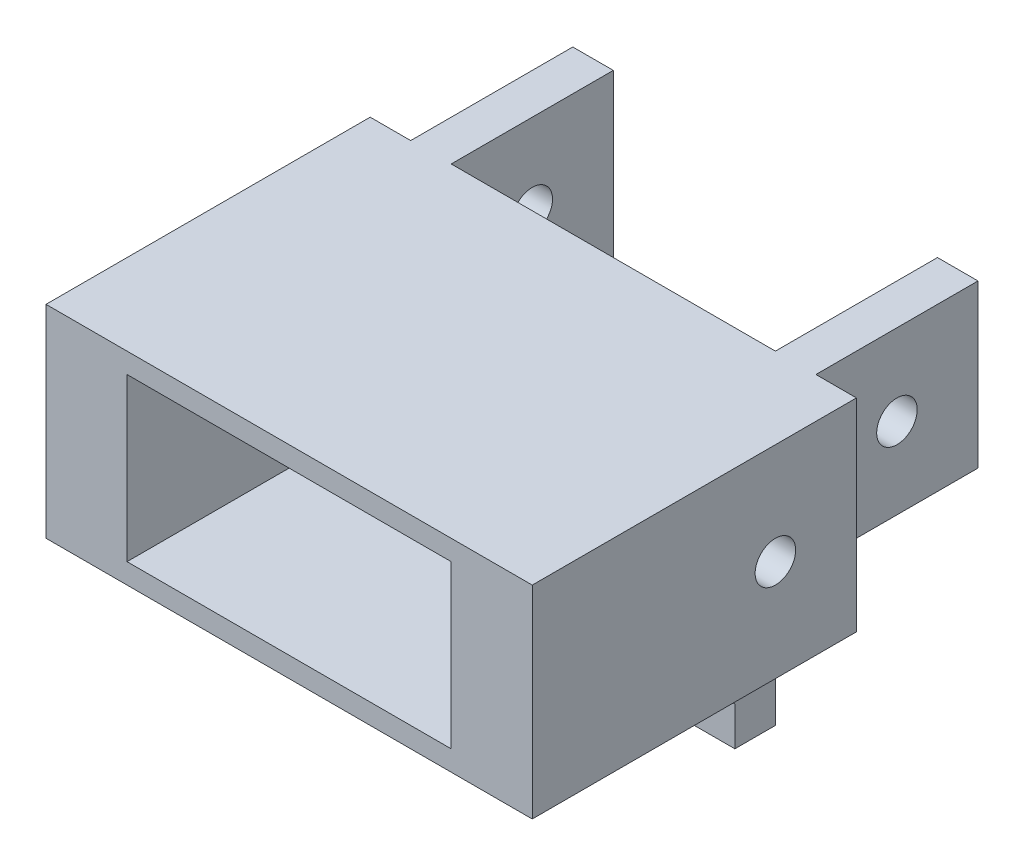
ISO-10303-21;
HEADER;
FILE_DESCRIPTION(('STEP AP214'),'2;1');
FILE_NAME('part.step','',(''),(''),'','','');
FILE_SCHEMA(('AUTOMOTIVE_DESIGN { 1 0 10303 214 1 1 1 1 }'));
ENDSEC;
DATA;
#1=APPLICATION_CONTEXT('core data for automotive mechanical design processes');
#2=APPLICATION_PROTOCOL_DEFINITION('international standard','automotive_design',2000,#1);
#3=PRODUCT_CONTEXT('',#1,'mechanical');
#4=PRODUCT('Part','Part','',(#3));
#5=PRODUCT_RELATED_PRODUCT_CATEGORY('part','',(#4));
#6=PRODUCT_DEFINITION_FORMATION('','',#4);
#7=PRODUCT_DEFINITION_CONTEXT('part definition',#1,'design');
#8=PRODUCT_DEFINITION('design','',#6,#7);
#9=PRODUCT_DEFINITION_SHAPE('','',#8);
#10=(LENGTH_UNIT() NAMED_UNIT(*) SI_UNIT(.MILLI.,.METRE.));
#11=(NAMED_UNIT(*) PLANE_ANGLE_UNIT() SI_UNIT($,.RADIAN.));
#12=(NAMED_UNIT(*) SI_UNIT($,.STERADIAN.) SOLID_ANGLE_UNIT());
#13=UNCERTAINTY_MEASURE_WITH_UNIT(LENGTH_MEASURE(1.E-05),#10,'distance_accuracy_value','');
#14=(GEOMETRIC_REPRESENTATION_CONTEXT(3) GLOBAL_UNCERTAINTY_ASSIGNED_CONTEXT((#13)) GLOBAL_UNIT_ASSIGNED_CONTEXT((#10,
#11,#12)) REPRESENTATION_CONTEXT('',''));
#15=CARTESIAN_POINT('',(0.,0.,0.));
#16=DIRECTION('',(0.,0.,1.));
#17=DIRECTION('',(1.,0.,0.));
#18=AXIS2_PLACEMENT_3D('',#15,#16,#17);
#19=CARTESIAN_POINT('',(4.80999618440597,-4.9502101992266,15.));
#20=DIRECTION('',(-1.,0.,0.));
#21=DIRECTION('',(0.,-1.,0.));
#22=AXIS2_PLACEMENT_3D('',#19,#20,#21);
#23=PLANE('',#22);
#24=DIRECTION('',(0.,0.707106781186548,0.707106781186547));
#25=VECTOR('',#24,1.);
#26=CARTESIAN_POINT('',(4.80999618440597,-4.9502101992266,15.));
#27=LINE('',#26,#25);
#28=CARTESIAN_POINT('',(4.80999618440597,-14.9502101992266,5.));
#29=VERTEX_POINT('',#28);
#30=CARTESIAN_POINT('',(4.80999618440597,-4.9502101992266,15.));
#31=VERTEX_POINT('',#30);
#32=EDGE_CURVE('E457',#29,#31,#27,.T.);
#33=ORIENTED_EDGE('',*,*,#32,.F.);
#34=DIRECTION('',(0.,1.,0.));
#35=VECTOR('',#34,1.);
#36=CARTESIAN_POINT('',(4.80999618440597,-4.9502101992266,5.));
#37=LINE('',#36,#35);
#38=CARTESIAN_POINT('',(4.80999618440597,-4.9502101992266,5.));
#39=VERTEX_POINT('',#38);
#40=EDGE_CURVE('E253',#29,#39,#37,.T.);
#41=ORIENTED_EDGE('',*,*,#40,.T.);
#42=DIRECTION('',(0.,0.,-1.));
#43=VECTOR('',#42,1.);
#44=CARTESIAN_POINT('',(4.80999618440597,-4.9502101992266,15.));
#45=LINE('',#44,#43);
#46=EDGE_CURVE('E66',#31,#39,#45,.T.);
#47=ORIENTED_EDGE('',*,*,#46,.F.);
#48=EDGE_LOOP('',(#33,#41,#47));
#49=FACE_BOUND('',#48,.T.);
#50=ADVANCED_FACE('F41',(#49),#23,.F.);
#51=CARTESIAN_POINT('',(-13.8285621725772,-4.9502101992266,15.));
#52=DIRECTION('',(1.,0.,0.));
#53=DIRECTION('',(0.,1.,0.));
#54=AXIS2_PLACEMENT_3D('',#51,#52,#53);
#55=PLANE('',#54);
#56=DIRECTION('',(0.,0.,-1.));
#57=VECTOR('',#56,1.);
#58=CARTESIAN_POINT('',(-13.8285621725772,-4.9502101992266,15.));
#59=LINE('',#58,#57);
#60=CARTESIAN_POINT('',(-13.8285621725772,-4.9502101992266,15.));
#61=VERTEX_POINT('',#60);
#62=CARTESIAN_POINT('',(-13.8285621725772,-4.9502101992266,5.));
#63=VERTEX_POINT('',#62);
#64=EDGE_CURVE('E265',#61,#63,#59,.T.);
#65=ORIENTED_EDGE('',*,*,#64,.F.);
#66=DIRECTION('',(0.,-0.707106781186548,-0.707106781186547));
#67=VECTOR('',#66,1.);
#68=CARTESIAN_POINT('',(-13.8285621725772,-4.9502101992266,15.));
#69=LINE('',#68,#67);
#70=CARTESIAN_POINT('',(-13.8285621725772,-14.9502101992266,5.));
#71=VERTEX_POINT('',#70);
#72=EDGE_CURVE('E459',#61,#71,#69,.T.);
#73=ORIENTED_EDGE('',*,*,#72,.T.);
#74=DIRECTION('',(0.,-1.,0.));
#75=VECTOR('',#74,1.);
#76=CARTESIAN_POINT('',(-13.8285621725772,-4.9502101992266,5.));
#77=LINE('',#76,#75);
#78=EDGE_CURVE('E266',#63,#71,#77,.T.);
#79=ORIENTED_EDGE('',*,*,#78,.F.);
#80=EDGE_LOOP('',(#65,#73,#79));
#81=FACE_BOUND('',#80,.T.);
#82=ADVANCED_FACE('F546',(#81),#55,.T.);
#83=CARTESIAN_POINT('',(0.,0.,5.));
#84=DIRECTION('',(0.,0.,-1.));
#85=DIRECTION('',(-1.,0.,0.));
#86=AXIS2_PLACEMENT_3D('',#83,#84,#85);
#87=PLANE('',#86);
#88=CARTESIAN_POINT('',(13.1714378274228,-9.9502101992266,5.));
#89=DIRECTION('',(0.,0.,1.));
#90=DIRECTION('',(1.,0.,0.));
#91=AXIS2_PLACEMENT_3D('',#88,#89,#90);
#92=CIRCLE('',#91,2.5);
#93=CARTESIAN_POINT('',(15.6714378274228,-9.9502101992266,5.));
#94=VERTEX_POINT('',#93);
#95=EDGE_CURVE('E424',#94,#94,#92,.T.);
#96=ORIENTED_EDGE('',*,*,#95,.F.);
#97=EDGE_LOOP('',(#96));
#98=FACE_BOUND('',#97,.T.);
#99=CARTESIAN_POINT('',(-6.82856217257722,-9.9502101992266,5.));
#100=DIRECTION('',(0.,0.,1.));
#101=DIRECTION('',(1.,0.,0.));
#102=AXIS2_PLACEMENT_3D('',#99,#100,#101);
#103=CIRCLE('',#102,2.49999999999999);
#104=CARTESIAN_POINT('',(-4.32856217257723,-9.9502101992266,5.));
#105=VERTEX_POINT('',#104);
#106=EDGE_CURVE('E410',#105,#105,#103,.T.);
#107=ORIENTED_EDGE('',*,*,#106,.F.);
#108=EDGE_LOOP('',(#107));
#109=FACE_BOUND('',#108,.T.);
#110=DIRECTION('',(0.,-1.,0.));
#111=VECTOR('',#110,1.);
#112=CARTESIAN_POINT('',(20.1714378274228,-4.9502101992266,5.));
#113=LINE('',#112,#111);
#114=CARTESIAN_POINT('',(20.1714378274228,-4.9502101992266,5.));
#115=VERTEX_POINT('',#114);
#116=CARTESIAN_POINT('',(20.1714378274228,-15.1699441027605,5.));
#117=VERTEX_POINT('',#116);
#118=EDGE_CURVE('E237',#115,#117,#113,.T.);
#119=ORIENTED_EDGE('',*,*,#118,.F.);
#120=DIRECTION('',(-1.,0.,0.));
#121=VECTOR('',#120,1.);
#122=CARTESIAN_POINT('',(23.1714378274228,-4.9502101992266,5.));
#123=LINE('',#122,#121);
#124=EDGE_CURVE('E440',#115,#39,#123,.T.);
#125=ORIENTED_EDGE('',*,*,#124,.T.);
#126=ORIENTED_EDGE('',*,*,#40,.F.);
#127=DIRECTION('',(1.,0.,0.));
#128=VECTOR('',#127,1.);
#129=CARTESIAN_POINT('',(1.80999618440597,-14.9502101992266,5.));
#130=LINE('',#129,#128);
#131=CARTESIAN_POINT('',(1.80999618440597,-14.9502101992266,5.));
#132=VERTEX_POINT('',#131);
#133=EDGE_CURVE('E255',#132,#29,#130,.T.);
#134=ORIENTED_EDGE('',*,*,#133,.F.);
#135=DIRECTION('',(0.,-1.,0.));
#136=VECTOR('',#135,1.);
#137=CARTESIAN_POINT('',(1.80999618440597,-4.9502101992266,5.));
#138=LINE('',#137,#136);
#139=CARTESIAN_POINT('',(1.80999618440597,-4.9502101992266,5.));
#140=VERTEX_POINT('',#139);
#141=EDGE_CURVE('E58',#140,#132,#138,.T.);
#142=ORIENTED_EDGE('',*,*,#141,.F.);
#143=EDGE_CURVE('E438',#140,#63,#123,.T.);
#144=ORIENTED_EDGE('',*,*,#143,.T.);
#145=ORIENTED_EDGE('',*,*,#78,.T.);
#146=DIRECTION('',(1.,0.,0.));
#147=VECTOR('',#146,1.);
#148=CARTESIAN_POINT('',(-16.8285621725772,-14.9502101992266,5.));
#149=LINE('',#148,#147);
#150=CARTESIAN_POINT('',(-16.8285621725772,-14.9502101992266,5.));
#151=VERTEX_POINT('',#150);
#152=EDGE_CURVE('E249',#151,#71,#149,.T.);
#153=ORIENTED_EDGE('',*,*,#152,.F.);
#154=DIRECTION('',(0.,1.,0.));
#155=VECTOR('',#154,1.);
#156=CARTESIAN_POINT('',(-16.8285621725772,-19.9502101992266,5.));
#157=LINE('',#156,#155);
#158=CARTESIAN_POINT('',(-16.8285621725772,-19.9502101992266,5.));
#159=VERTEX_POINT('',#158);
#160=EDGE_CURVE('E436',#159,#151,#157,.T.);
#161=ORIENTED_EDGE('',*,*,#160,.F.);
#162=DIRECTION('',(-1.,0.,0.));
#163=VECTOR('',#162,1.);
#164=CARTESIAN_POINT('',(23.1714378274228,-19.9502101992266,5.));
#165=LINE('',#164,#163);
#166=CARTESIAN_POINT('',(23.1714378274228,-19.9502101992266,5.));
#167=VERTEX_POINT('',#166);
#168=EDGE_CURVE('E432',#167,#159,#165,.T.);
#169=ORIENTED_EDGE('',*,*,#168,.F.);
#170=DIRECTION('',(0.,-1.,0.));
#171=VECTOR('',#170,1.);
#172=CARTESIAN_POINT('',(23.1714378274228,-4.9502101992266,5.));
#173=LINE('',#172,#171);
#174=CARTESIAN_POINT('',(23.1714378274228,-15.1699441027605,5.));
#175=VERTEX_POINT('',#174);
#176=EDGE_CURVE('E244',#175,#167,#173,.T.);
#177=ORIENTED_EDGE('',*,*,#176,.F.);
#178=DIRECTION('',(1.,0.,0.));
#179=VECTOR('',#178,1.);
#180=CARTESIAN_POINT('',(20.1714378274228,-15.1699441027605,5.));
#181=LINE('',#180,#179);
#182=EDGE_CURVE('E228',#117,#175,#181,.T.);
#183=ORIENTED_EDGE('',*,*,#182,.F.);
#184=EDGE_LOOP('',(#119,#125,#126,#134,#142,#144,#145,#153,#161,#169,#177,#183));
#185=FACE_BOUND('',#184,.T.);
#186=ADVANCED_FACE('F242',(#98,#109,#185),#87,.F.);
#187=CARTESIAN_POINT('',(33.1714378274228,-4.9502101992266,40.));
#188=DIRECTION('',(0.,-1.,0.));
#189=DIRECTION('',(1.,0.,0.));
#190=AXIS2_PLACEMENT_3D('',#187,#188,#189);
#191=PLANE('',#190);
#192=ORIENTED_EDGE('',*,*,#124,.F.);
#193=DIRECTION('',(0.,0.,-1.));
#194=VECTOR('',#193,1.);
#195=CARTESIAN_POINT('',(20.1714378274228,-4.9502101992266,15.));
#196=LINE('',#195,#194);
#197=CARTESIAN_POINT('',(20.1714378274228,-4.9502101992266,15.));
#198=VERTEX_POINT('',#197);
#199=EDGE_CURVE('E239',#198,#115,#196,.T.);
#200=ORIENTED_EDGE('',*,*,#199,.F.);
#201=DIRECTION('',(-1.,0.,0.));
#202=VECTOR('',#201,1.);
#203=CARTESIAN_POINT('',(20.1714378274228,-4.9502101992266,15.));
#204=LINE('',#203,#202);
#205=CARTESIAN_POINT('',(23.1714378274228,-4.9502101992266,15.));
#206=VERTEX_POINT('',#205);
#207=EDGE_CURVE('E231',#206,#198,#204,.T.);
#208=ORIENTED_EDGE('',*,*,#207,.F.);
#209=DIRECTION('',(0.,0.,-1.));
#210=VECTOR('',#209,1.);
#211=CARTESIAN_POINT('',(23.1714378274228,-4.9502101992266,5.));
#212=LINE('',#211,#210);
#213=CARTESIAN_POINT('',(23.1714378274228,-4.9502101992266,0.));
#214=VERTEX_POINT('',#213);
#215=EDGE_CURVE('E11',#206,#214,#212,.T.);
#216=ORIENTED_EDGE('',*,*,#215,.T.);
#217=DIRECTION('',(-1.,0.,0.));
#218=VECTOR('',#217,1.);
#219=CARTESIAN_POINT('',(33.1714378274228,-4.9502101992266,0.));
#220=LINE('',#219,#218);
#221=CARTESIAN_POINT('',(33.1714378274228,-4.9502101992266,0.));
#222=VERTEX_POINT('',#221);
#223=EDGE_CURVE('E387',#222,#214,#220,.T.);
#224=ORIENTED_EDGE('',*,*,#223,.F.);
#225=DIRECTION('',(0.,0.,-1.));
#226=VECTOR('',#225,1.);
#227=CARTESIAN_POINT('',(33.1714378274228,-4.9502101992266,40.));
#228=LINE('',#227,#226);
#229=CARTESIAN_POINT('',(33.1714378274228,-4.9502101992266,40.));
#230=VERTEX_POINT('',#229);
#231=EDGE_CURVE('E408',#230,#222,#228,.T.);
#232=ORIENTED_EDGE('',*,*,#231,.F.);
#233=DIRECTION('',(-1.,0.,0.));
#234=VECTOR('',#233,1.);
#235=CARTESIAN_POINT('',(23.1714378274228,-4.9502101992266,40.));
#236=LINE('',#235,#234);
#237=CARTESIAN_POINT('',(-26.8285621725772,-4.95021019922661,40.));
#238=VERTEX_POINT('',#237);
#239=EDGE_CURVE('E384',#230,#238,#236,.T.);
#240=ORIENTED_EDGE('',*,*,#239,.T.);
#241=DIRECTION('',(0.,0.,-1.));
#242=VECTOR('',#241,1.);
#243=CARTESIAN_POINT('',(-26.8285621725772,-4.95021019922661,40.));
#244=LINE('',#243,#242);
#245=CARTESIAN_POINT('',(-26.8285621725772,-4.95021019922661,0.));
#246=VERTEX_POINT('',#245);
#247=EDGE_CURVE('E395',#238,#246,#244,.T.);
#248=ORIENTED_EDGE('',*,*,#247,.T.);
#249=CARTESIAN_POINT('',(-16.8285621725772,-4.9502101992266,0.));
#250=VERTEX_POINT('',#249);
#251=EDGE_CURVE('E405',#250,#246,#220,.T.);
#252=ORIENTED_EDGE('',*,*,#251,.F.);
#253=DIRECTION('',(0.,0.,-1.));
#254=VECTOR('',#253,1.);
#255=CARTESIAN_POINT('',(-16.8285621725772,-4.9502101992266,5.));
#256=LINE('',#255,#254);
#257=CARTESIAN_POINT('',(-16.8285621725772,-4.9502101992266,15.));
#258=VERTEX_POINT('',#257);
#259=EDGE_CURVE('E50',#258,#250,#256,.T.);
#260=ORIENTED_EDGE('',*,*,#259,.F.);
#261=DIRECTION('',(1.,0.,0.));
#262=VECTOR('',#261,1.);
#263=CARTESIAN_POINT('',(-16.8285621725772,-4.9502101992266,15.));
#264=LINE('',#263,#262);
#265=EDGE_CURVE('E263',#258,#61,#264,.T.);
#266=ORIENTED_EDGE('',*,*,#265,.T.);
#267=ORIENTED_EDGE('',*,*,#64,.T.);
#268=ORIENTED_EDGE('',*,*,#143,.F.);
#269=DIRECTION('',(0.,0.,-1.));
#270=VECTOR('',#269,1.);
#271=CARTESIAN_POINT('',(1.80999618440597,-4.9502101992266,15.));
#272=LINE('',#271,#270);
#273=CARTESIAN_POINT('',(1.80999618440597,-4.9502101992266,15.));
#274=VERTEX_POINT('',#273);
#275=EDGE_CURVE('E252',#274,#140,#272,.T.);
#276=ORIENTED_EDGE('',*,*,#275,.F.);
#277=DIRECTION('',(-1.,0.,0.));
#278=VECTOR('',#277,1.);
#279=CARTESIAN_POINT('',(1.80999618440597,-4.9502101992266,15.));
#280=LINE('',#279,#278);
#281=EDGE_CURVE('E250',#31,#274,#280,.T.);
#282=ORIENTED_EDGE('',*,*,#281,.F.);
#283=ORIENTED_EDGE('',*,*,#46,.T.);
#284=EDGE_LOOP('',(#192,#200,#208,#216,#224,#232,#240,#248,#252,#260,#266,#267,#268,#276,#282,#283));
#285=FACE_BOUND('',#284,.T.);
#286=ADVANCED_FACE('F479',(#285),#191,.T.);
#287=CARTESIAN_POINT('',(0.,0.,0.));
#288=DIRECTION('',(0.,0.,-1.));
#289=DIRECTION('',(-1.,0.,0.));
#290=AXIS2_PLACEMENT_3D('',#287,#288,#289);
#291=PLANE('',#290);
#292=DIRECTION('',(0.,-1.,0.));
#293=VECTOR('',#292,1.);
#294=CARTESIAN_POINT('',(-21.8285621725772,20.0497898007734,0.));
#295=LINE('',#294,#293);
#296=CARTESIAN_POINT('',(-21.8285621725772,20.0497898007734,0.));
#297=VERTEX_POINT('',#296);
#298=CARTESIAN_POINT('',(-21.8285621725772,0.0497898007734004,0.));
#299=VERTEX_POINT('',#298);
#300=EDGE_CURVE('E329',#297,#299,#295,.T.);
#301=ORIENTED_EDGE('',*,*,#300,.T.);
#302=DIRECTION('',(1.,0.,0.));
#303=VECTOR('',#302,1.);
#304=CARTESIAN_POINT('',(-21.8285621725772,0.0497898007734004,0.));
#305=LINE('',#304,#303);
#306=CARTESIAN_POINT('',(-16.8285621725772,0.0497898007734004,0.));
#307=VERTEX_POINT('',#306);
#308=EDGE_CURVE('E324',#299,#307,#305,.T.);
#309=ORIENTED_EDGE('',*,*,#308,.T.);
#310=DIRECTION('',(0.,1.,0.));
#311=VECTOR('',#310,1.);
#312=CARTESIAN_POINT('',(-16.8285621725772,0.0497898007734004,0.));
#313=LINE('',#312,#311);
#314=CARTESIAN_POINT('',(-16.8285621725772,20.0497898007734,0.));
#315=VERTEX_POINT('',#314);
#316=EDGE_CURVE('E339',#307,#315,#313,.T.);
#317=ORIENTED_EDGE('',*,*,#316,.T.);
#318=DIRECTION('',(1.,0.,0.));
#319=VECTOR('',#318,1.);
#320=CARTESIAN_POINT('',(28.1714378274228,20.0497898007734,0.));
#321=LINE('',#320,#319);
#322=CARTESIAN_POINT('',(23.1714378274228,20.0497898007734,0.));
#323=VERTEX_POINT('',#322);
#324=EDGE_CURVE('E402',#315,#323,#321,.T.);
#325=ORIENTED_EDGE('',*,*,#324,.T.);
#326=DIRECTION('',(0.,-1.,0.));
#327=VECTOR('',#326,1.);
#328=CARTESIAN_POINT('',(23.1714378274228,20.0497898007734,0.));
#329=LINE('',#328,#327);
#330=CARTESIAN_POINT('',(23.1714378274228,0.0497898007734039,0.));
#331=VERTEX_POINT('',#330);
#332=EDGE_CURVE('E346',#323,#331,#329,.T.);
#333=ORIENTED_EDGE('',*,*,#332,.T.);
#334=DIRECTION('',(1.,0.,0.));
#335=VECTOR('',#334,1.);
#336=CARTESIAN_POINT('',(23.1714378274228,0.0497898007734039,0.));
#337=LINE('',#336,#335);
#338=CARTESIAN_POINT('',(28.1714378274228,0.0497898007734039,0.));
#339=VERTEX_POINT('',#338);
#340=EDGE_CURVE('E370',#331,#339,#337,.T.);
#341=ORIENTED_EDGE('',*,*,#340,.T.);
#342=DIRECTION('',(0.,1.,0.));
#343=VECTOR('',#342,1.);
#344=CARTESIAN_POINT('',(28.1714378274228,0.0497898007734039,0.));
#345=LINE('',#344,#343);
#346=CARTESIAN_POINT('',(28.1714378274228,20.0497898007734,0.));
#347=VERTEX_POINT('',#346);
#348=EDGE_CURVE('E359',#339,#347,#345,.T.);
#349=ORIENTED_EDGE('',*,*,#348,.T.);
#350=CARTESIAN_POINT('',(33.1714378274228,20.0497898007734,0.));
#351=VERTEX_POINT('',#350);
#352=EDGE_CURVE('E398',#347,#351,#321,.T.);
#353=ORIENTED_EDGE('',*,*,#352,.T.);
#354=DIRECTION('',(0.,-1.,0.));
#355=VECTOR('',#354,1.);
#356=CARTESIAN_POINT('',(33.1714378274228,20.0497898007734,0.));
#357=LINE('',#356,#355);
#358=EDGE_CURVE('E401',#351,#222,#357,.T.);
#359=ORIENTED_EDGE('',*,*,#358,.T.);
#360=ORIENTED_EDGE('',*,*,#223,.T.);
#361=DIRECTION('',(0.,-1.,0.));
#362=VECTOR('',#361,1.);
#363=CARTESIAN_POINT('',(23.1714378274228,-4.9502101992266,0.));
#364=LINE('',#363,#362);
#365=CARTESIAN_POINT('',(23.1714378274228,-19.9502101992266,0.));
#366=VERTEX_POINT('',#365);
#367=EDGE_CURVE('E430',#214,#366,#364,.T.);
#368=ORIENTED_EDGE('',*,*,#367,.T.);
#369=DIRECTION('',(-1.,0.,0.));
#370=VECTOR('',#369,1.);
#371=CARTESIAN_POINT('',(23.1714378274228,-19.9502101992266,0.));
#372=LINE('',#371,#370);
#373=CARTESIAN_POINT('',(-16.8285621725772,-19.9502101992266,0.));
#374=VERTEX_POINT('',#373);
#375=EDGE_CURVE('E443',#366,#374,#372,.T.);
#376=ORIENTED_EDGE('',*,*,#375,.T.);
#377=DIRECTION('',(0.,1.,0.));
#378=VECTOR('',#377,1.);
#379=CARTESIAN_POINT('',(-16.8285621725772,-19.9502101992266,0.));
#380=LINE('',#379,#378);
#381=EDGE_CURVE('E433',#374,#250,#380,.T.);
#382=ORIENTED_EDGE('',*,*,#381,.T.);
#383=ORIENTED_EDGE('',*,*,#251,.T.);
#384=DIRECTION('',(0.,1.,0.));
#385=VECTOR('',#384,1.);
#386=CARTESIAN_POINT('',(-26.8285621725772,-4.95021019922661,0.));
#387=LINE('',#386,#385);
#388=CARTESIAN_POINT('',(-26.8285621725772,20.0497898007734,0.));
#389=VERTEX_POINT('',#388);
#390=EDGE_CURVE('E378',#246,#389,#387,.T.);
#391=ORIENTED_EDGE('',*,*,#390,.T.);
#392=EDGE_CURVE('E399',#389,#297,#321,.T.);
#393=ORIENTED_EDGE('',*,*,#392,.T.);
#394=EDGE_LOOP('',(#301,#309,#317,#325,#333,#341,#349,#353,#359,#360,#368,#376,#382,#383,#391,#393));
#395=FACE_BOUND('',#394,.T.);
#396=CARTESIAN_POINT('',(13.1714378274228,-9.9502101992266,0.));
#397=DIRECTION('',(0.,0.,1.));
#398=DIRECTION('',(1.,0.,0.));
#399=AXIS2_PLACEMENT_3D('',#396,#397,#398);
#400=CIRCLE('',#399,2.5);
#401=CARTESIAN_POINT('',(15.6714378274228,-9.9502101992266,0.));
#402=VERTEX_POINT('',#401);
#403=EDGE_CURVE('E427',#402,#402,#400,.T.);
#404=ORIENTED_EDGE('',*,*,#403,.T.);
#405=EDGE_LOOP('',(#404));
#406=FACE_BOUND('',#405,.T.);
#407=CARTESIAN_POINT('',(-6.82856217257722,-9.9502101992266,0.));
#408=DIRECTION('',(0.,0.,1.));
#409=DIRECTION('',(1.,0.,0.));
#410=AXIS2_PLACEMENT_3D('',#407,#408,#409);
#411=CIRCLE('',#410,2.5);
#412=CARTESIAN_POINT('',(-4.32856217257722,-9.9502101992266,0.));
#413=VERTEX_POINT('',#412);
#414=EDGE_CURVE('E421',#413,#413,#411,.T.);
#415=ORIENTED_EDGE('',*,*,#414,.T.);
#416=EDGE_LOOP('',(#415));
#417=FACE_BOUND('',#416,.T.);
#418=ADVANCED_FACE('F484',(#395,#406,#417),#291,.T.);
#419=CARTESIAN_POINT('',(23.1714378274228,-4.9502101992266,5.));
#420=DIRECTION('',(1.,0.,0.));
#421=DIRECTION('',(0.,1.,0.));
#422=AXIS2_PLACEMENT_3D('',#419,#420,#421);
#423=PLANE('',#422);
#424=DIRECTION('',(0.,0.714748918301449,0.699381143431039));
#425=VECTOR('',#424,1.);
#426=CARTESIAN_POINT('',(23.1714378274228,-4.9502101992266,15.));
#427=LINE('',#426,#425);
#428=EDGE_CURVE('E234',#175,#206,#427,.T.);
#429=ORIENTED_EDGE('',*,*,#428,.F.);
#430=ORIENTED_EDGE('',*,*,#176,.T.);
#431=DIRECTION('',(0.,0.,-1.));
#432=VECTOR('',#431,1.);
#433=CARTESIAN_POINT('',(23.1714378274228,-19.9502101992266,5.));
#434=LINE('',#433,#432);
#435=EDGE_CURVE('E450',#167,#366,#434,.T.);
#436=ORIENTED_EDGE('',*,*,#435,.T.);
#437=ORIENTED_EDGE('',*,*,#367,.F.);
#438=ORIENTED_EDGE('',*,*,#215,.F.);
#439=EDGE_LOOP('',(#429,#430,#436,#437,#438));
#440=FACE_BOUND('',#439,.T.);
#441=ADVANCED_FACE('F43',(#440),#423,.T.);
#442=CARTESIAN_POINT('',(-16.8285621725772,-19.9502101992266,5.));
#443=DIRECTION('',(-1.,0.,0.));
#444=DIRECTION('',(0.,0.,1.));
#445=AXIS2_PLACEMENT_3D('',#442,#443,#444);
#446=PLANE('',#445);
#447=DIRECTION('',(0.,-0.707106781186548,-0.707106781186547));
#448=VECTOR('',#447,1.);
#449=CARTESIAN_POINT('',(-16.8285621725772,-4.9502101992266,15.));
#450=LINE('',#449,#448);
#451=EDGE_CURVE('E256',#258,#151,#450,.T.);
#452=ORIENTED_EDGE('',*,*,#451,.F.);
#453=ORIENTED_EDGE('',*,*,#259,.T.);
#454=ORIENTED_EDGE('',*,*,#381,.F.);
#455=DIRECTION('',(0.,0.,-1.));
#456=VECTOR('',#455,1.);
#457=CARTESIAN_POINT('',(-16.8285621725772,-19.9502101992266,5.));
#458=LINE('',#457,#456);
#459=EDGE_CURVE('E449',#159,#374,#458,.T.);
#460=ORIENTED_EDGE('',*,*,#459,.F.);
#461=ORIENTED_EDGE('',*,*,#160,.T.);
#462=EDGE_LOOP('',(#452,#453,#454,#460,#461));
#463=FACE_BOUND('',#462,.T.);
#464=ADVANCED_FACE('F475',(#463),#446,.T.);
#465=CARTESIAN_POINT('',(23.1714378274228,-19.9502101992266,5.));
#466=DIRECTION('',(0.,-1.,0.));
#467=DIRECTION('',(1.,0.,0.));
#468=AXIS2_PLACEMENT_3D('',#465,#466,#467);
#469=PLANE('',#468);
#470=ORIENTED_EDGE('',*,*,#375,.F.);
#471=ORIENTED_EDGE('',*,*,#435,.F.);
#472=ORIENTED_EDGE('',*,*,#168,.T.);
#473=ORIENTED_EDGE('',*,*,#459,.T.);
#474=EDGE_LOOP('',(#470,#471,#472,#473));
#475=FACE_BOUND('',#474,.T.);
#476=ADVANCED_FACE('F487',(#475),#469,.T.);
#477=CARTESIAN_POINT('',(13.1714378274228,-9.9502101992266,5.));
#478=DIRECTION('',(0.,0.,1.));
#479=DIRECTION('',(1.,0.,0.));
#480=AXIS2_PLACEMENT_3D('',#477,#478,#479);
#481=CYLINDRICAL_SURFACE('',#480,2.5);
#482=ORIENTED_EDGE('',*,*,#403,.F.);
#483=EDGE_LOOP('',(#482));
#484=FACE_BOUND('',#483,.T.);
#485=ORIENTED_EDGE('',*,*,#95,.T.);
#486=EDGE_LOOP('',(#485));
#487=FACE_BOUND('',#486,.T.);
#488=ADVANCED_FACE('F771',(#484,#487),#481,.F.);
#489=CARTESIAN_POINT('',(-6.82856217257722,-9.9502101992266,5.));
#490=DIRECTION('',(0.,0.,1.));
#491=DIRECTION('',(1.,0.,0.));
#492=AXIS2_PLACEMENT_3D('',#489,#490,#491);
#493=CYLINDRICAL_SURFACE('',#492,2.49999999999999);
#494=ORIENTED_EDGE('',*,*,#414,.F.);
#495=EDGE_LOOP('',(#494));
#496=FACE_BOUND('',#495,.T.);
#497=ORIENTED_EDGE('',*,*,#106,.T.);
#498=EDGE_LOOP('',(#497));
#499=FACE_BOUND('',#498,.T.);
#500=ADVANCED_FACE('F651',(#496,#499),#493,.F.);
#501=CARTESIAN_POINT('',(33.1714378274228,20.0497898007734,40.));
#502=DIRECTION('',(1.,0.,0.));
#503=DIRECTION('',(0.,0.,-1.));
#504=AXIS2_PLACEMENT_3D('',#501,#502,#503);
#505=PLANE('',#504);
#506=CARTESIAN_POINT('',(33.1714378274228,7.5497898007734,10.));
#507=DIRECTION('',(1.,0.,0.));
#508=DIRECTION('',(0.,0.,-1.));
#509=AXIS2_PLACEMENT_3D('',#506,#507,#508);
#510=CIRCLE('',#509,2.49999999999999);
#511=CARTESIAN_POINT('',(33.1714378274228,7.5497898007734,7.50000000000001));
#512=VERTEX_POINT('',#511);
#513=EDGE_CURVE('E273',#512,#512,#510,.T.);
#514=ORIENTED_EDGE('',*,*,#513,.F.);
#515=EDGE_LOOP('',(#514));
#516=FACE_BOUND('',#515,.T.);
#517=ORIENTED_EDGE('',*,*,#358,.F.);
#518=DIRECTION('',(0.,0.,-1.));
#519=VECTOR('',#518,1.);
#520=CARTESIAN_POINT('',(33.1714378274228,20.0497898007734,40.));
#521=LINE('',#520,#519);
#522=CARTESIAN_POINT('',(33.1714378274228,20.0497898007734,40.));
#523=VERTEX_POINT('',#522);
#524=EDGE_CURVE('E411',#523,#351,#521,.T.);
#525=ORIENTED_EDGE('',*,*,#524,.F.);
#526=DIRECTION('',(0.,-1.,0.));
#527=VECTOR('',#526,1.);
#528=CARTESIAN_POINT('',(33.1714378274228,20.0497898007734,40.));
#529=LINE('',#528,#527);
#530=EDGE_CURVE('E392',#523,#230,#529,.T.);
#531=ORIENTED_EDGE('',*,*,#530,.T.);
#532=ORIENTED_EDGE('',*,*,#231,.T.);
#533=EDGE_LOOP('',(#517,#525,#531,#532));
#534=FACE_BOUND('',#533,.T.);
#535=ADVANCED_FACE('F495',(#516,#534),#505,.T.);
#536=CARTESIAN_POINT('',(28.1714378274228,20.0497898007734,40.));
#537=DIRECTION('',(0.,1.,0.));
#538=DIRECTION('',(-1.,0.,0.));
#539=AXIS2_PLACEMENT_3D('',#536,#537,#538);
#540=PLANE('',#539);
#541=ORIENTED_EDGE('',*,*,#392,.F.);
#542=DIRECTION('',(0.,0.,-1.));
#543=VECTOR('',#542,1.);
#544=CARTESIAN_POINT('',(-26.8285621725772,20.0497898007734,40.));
#545=LINE('',#544,#543);
#546=CARTESIAN_POINT('',(-26.8285621725772,20.0497898007734,40.));
#547=VERTEX_POINT('',#546);
#548=EDGE_CURVE('E414',#547,#389,#545,.T.);
#549=ORIENTED_EDGE('',*,*,#548,.F.);
#550=DIRECTION('',(1.,0.,0.));
#551=VECTOR('',#550,1.);
#552=CARTESIAN_POINT('',(-26.8285621725772,20.0497898007734,40.));
#553=LINE('',#552,#551);
#554=EDGE_CURVE('E390',#547,#523,#553,.T.);
#555=ORIENTED_EDGE('',*,*,#554,.T.);
#556=ORIENTED_EDGE('',*,*,#524,.T.);
#557=ORIENTED_EDGE('',*,*,#352,.F.);
#558=DIRECTION('',(0.,0.,1.));
#559=VECTOR('',#558,1.);
#560=CARTESIAN_POINT('',(28.1714378274228,20.0497898007734,-20.));
#561=LINE('',#560,#559);
#562=CARTESIAN_POINT('',(28.1714378274228,20.0497898007734,-20.));
#563=VERTEX_POINT('',#562);
#564=EDGE_CURVE('E379',#563,#347,#561,.T.);
#565=ORIENTED_EDGE('',*,*,#564,.F.);
#566=DIRECTION('',(1.,0.,0.));
#567=VECTOR('',#566,1.);
#568=CARTESIAN_POINT('',(23.1714378274228,20.0497898007734,-20.));
#569=LINE('',#568,#567);
#570=CARTESIAN_POINT('',(23.1714378274228,20.0497898007734,-20.));
#571=VERTEX_POINT('',#570);
#572=EDGE_CURVE('E365',#571,#563,#569,.T.);
#573=ORIENTED_EDGE('',*,*,#572,.F.);
#574=DIRECTION('',(0.,0.,1.));
#575=VECTOR('',#574,1.);
#576=CARTESIAN_POINT('',(23.1714378274228,20.0497898007734,-20.));
#577=LINE('',#576,#575);
#578=EDGE_CURVE('E375',#571,#323,#577,.T.);
#579=ORIENTED_EDGE('',*,*,#578,.T.);
#580=ORIENTED_EDGE('',*,*,#324,.F.);
#581=DIRECTION('',(0.,0.,1.));
#582=VECTOR('',#581,1.);
#583=CARTESIAN_POINT('',(-16.8285621725772,20.0497898007734,-20.));
#584=LINE('',#583,#582);
#585=CARTESIAN_POINT('',(-16.8285621725772,20.0497898007734,-20.));
#586=VERTEX_POINT('',#585);
#587=EDGE_CURVE('E350',#586,#315,#584,.T.);
#588=ORIENTED_EDGE('',*,*,#587,.F.);
#589=DIRECTION('',(1.,0.,0.));
#590=VECTOR('',#589,1.);
#591=CARTESIAN_POINT('',(-21.8285621725772,20.0497898007734,-20.));
#592=LINE('',#591,#590);
#593=CARTESIAN_POINT('',(-21.8285621725772,20.0497898007734,-20.));
#594=VERTEX_POINT('',#593);
#595=EDGE_CURVE('E332',#594,#586,#592,.T.);
#596=ORIENTED_EDGE('',*,*,#595,.F.);
#597=DIRECTION('',(0.,0.,1.));
#598=VECTOR('',#597,1.);
#599=CARTESIAN_POINT('',(-21.8285621725772,20.0497898007734,-20.));
#600=LINE('',#599,#598);
#601=EDGE_CURVE('E347',#594,#297,#600,.T.);
#602=ORIENTED_EDGE('',*,*,#601,.T.);
#603=EDGE_LOOP('',(#541,#549,#555,#556,#557,#565,#573,#579,#580,#588,#596,#602));
#604=FACE_BOUND('',#603,.T.);
#605=ADVANCED_FACE('F503',(#604),#540,.T.);
#606=CARTESIAN_POINT('',(-26.8285621725772,-4.95021019922661,40.));
#607=DIRECTION('',(-1.,0.,0.));
#608=DIRECTION('',(0.,0.,1.));
#609=AXIS2_PLACEMENT_3D('',#606,#607,#608);
#610=PLANE('',#609);
#611=CARTESIAN_POINT('',(-26.8285621725772,7.5497898007734,10.));
#612=DIRECTION('',(1.,0.,0.));
#613=DIRECTION('',(0.,0.,-1.));
#614=AXIS2_PLACEMENT_3D('',#611,#612,#613);
#615=CIRCLE('',#614,2.49999999999999);
#616=CARTESIAN_POINT('',(-26.8285621725772,7.5497898007734,7.50000000000001));
#617=VERTEX_POINT('',#616);
#618=EDGE_CURVE('E276',#617,#617,#615,.T.);
#619=ORIENTED_EDGE('',*,*,#618,.T.);
#620=EDGE_LOOP('',(#619));
#621=FACE_BOUND('',#620,.T.);
#622=ORIENTED_EDGE('',*,*,#390,.F.);
#623=ORIENTED_EDGE('',*,*,#247,.F.);
#624=DIRECTION('',(0.,1.,0.));
#625=VECTOR('',#624,1.);
#626=CARTESIAN_POINT('',(-26.8285621725772,-4.95021019922661,40.));
#627=LINE('',#626,#625);
#628=EDGE_CURVE('E386',#238,#547,#627,.T.);
#629=ORIENTED_EDGE('',*,*,#628,.T.);
#630=ORIENTED_EDGE('',*,*,#548,.T.);
#631=EDGE_LOOP('',(#622,#623,#629,#630));
#632=FACE_BOUND('',#631,.T.);
#633=ADVANCED_FACE('F501',(#621,#632),#610,.T.);
#634=CARTESIAN_POINT('',(0.,0.,40.));
#635=DIRECTION('',(0.,0.,-1.));
#636=DIRECTION('',(-1.,0.,0.));
#637=AXIS2_PLACEMENT_3D('',#634,#635,#636);
#638=PLANE('',#637);
#639=DIRECTION('',(1.,0.,0.));
#640=VECTOR('',#639,1.);
#641=CARTESIAN_POINT('',(-16.8285621725772,-2.45021019922659,40.));
#642=LINE('',#641,#640);
#643=CARTESIAN_POINT('',(-16.8285621725772,-2.45021019922659,40.));
#644=VERTEX_POINT('',#643);
#645=CARTESIAN_POINT('',(23.1714378274228,-2.45021019922659,40.));
#646=VERTEX_POINT('',#645);
#647=EDGE_CURVE('E296',#644,#646,#642,.T.);
#648=ORIENTED_EDGE('',*,*,#647,.F.);
#649=DIRECTION('',(0.,-1.,0.));
#650=VECTOR('',#649,1.);
#651=CARTESIAN_POINT('',(-16.8285621725772,17.5497898007734,40.));
#652=LINE('',#651,#650);
#653=CARTESIAN_POINT('',(-16.8285621725772,17.5497898007734,40.));
#654=VERTEX_POINT('',#653);
#655=EDGE_CURVE('E282',#654,#644,#652,.T.);
#656=ORIENTED_EDGE('',*,*,#655,.F.);
#657=DIRECTION('',(1.,0.,0.));
#658=VECTOR('',#657,1.);
#659=CARTESIAN_POINT('',(-16.8285621725772,17.5497898007734,40.));
#660=LINE('',#659,#658);
#661=CARTESIAN_POINT('',(23.1714378274228,17.5497898007734,40.));
#662=VERTEX_POINT('',#661);
#663=EDGE_CURVE('E287',#654,#662,#660,.T.);
#664=ORIENTED_EDGE('',*,*,#663,.T.);
#665=DIRECTION('',(0.,-1.,0.));
#666=VECTOR('',#665,1.);
#667=CARTESIAN_POINT('',(23.1714378274228,17.5497898007734,40.));
#668=LINE('',#667,#666);
#669=EDGE_CURVE('E299',#662,#646,#668,.T.);
#670=ORIENTED_EDGE('',*,*,#669,.T.);
#671=EDGE_LOOP('',(#648,#656,#664,#670));
#672=FACE_BOUND('',#671,.T.);
#673=ORIENTED_EDGE('',*,*,#239,.F.);
#674=ORIENTED_EDGE('',*,*,#530,.F.);
#675=ORIENTED_EDGE('',*,*,#554,.F.);
#676=ORIENTED_EDGE('',*,*,#628,.F.);
#677=EDGE_LOOP('',(#673,#674,#675,#676));
#678=FACE_BOUND('',#677,.T.);
#679=ADVANCED_FACE('F498',(#672,#678),#638,.F.);
#680=CARTESIAN_POINT('',(23.1714378274228,20.0497898007734,-20.));
#681=DIRECTION('',(-1.,0.,0.));
#682=DIRECTION('',(0.,-1.,0.));
#683=AXIS2_PLACEMENT_3D('',#680,#681,#682);
#684=PLANE('',#683);
#685=CARTESIAN_POINT('',(23.1714378274228,10.0497898007734,-10.));
#686=DIRECTION('',(-1.,0.,0.));
#687=DIRECTION('',(0.,-1.,0.));
#688=AXIS2_PLACEMENT_3D('',#685,#686,#687);
#689=CIRCLE('',#688,2.49999999999999);
#690=CARTESIAN_POINT('',(23.1714378274228,7.54978980077341,-10.));
#691=VERTEX_POINT('',#690);
#692=EDGE_CURVE('E321',#691,#691,#689,.T.);
#693=ORIENTED_EDGE('',*,*,#692,.F.);
#694=EDGE_LOOP('',(#693));
#695=FACE_BOUND('',#694,.T.);
#696=ORIENTED_EDGE('',*,*,#332,.F.);
#697=ORIENTED_EDGE('',*,*,#578,.F.);
#698=DIRECTION('',(0.,-1.,0.));
#699=VECTOR('',#698,1.);
#700=CARTESIAN_POINT('',(23.1714378274228,20.0497898007734,-20.));
#701=LINE('',#700,#699);
#702=CARTESIAN_POINT('',(23.1714378274228,0.0497898007734039,-20.));
#703=VERTEX_POINT('',#702);
#704=EDGE_CURVE('E355',#571,#703,#701,.T.);
#705=ORIENTED_EDGE('',*,*,#704,.T.);
#706=DIRECTION('',(0.,0.,1.));
#707=VECTOR('',#706,1.);
#708=CARTESIAN_POINT('',(23.1714378274228,0.0497898007734039,-20.));
#709=LINE('',#708,#707);
#710=EDGE_CURVE('E367',#703,#331,#709,.T.);
#711=ORIENTED_EDGE('',*,*,#710,.T.);
#712=EDGE_LOOP('',(#696,#697,#705,#711));
#713=FACE_BOUND('',#712,.T.);
#714=ADVANCED_FACE('F523',(#695,#713),#684,.T.);
#715=CARTESIAN_POINT('',(28.1714378274228,0.0497898007734039,-20.));
#716=DIRECTION('',(1.,0.,0.));
#717=DIRECTION('',(0.,0.,-1.));
#718=AXIS2_PLACEMENT_3D('',#715,#716,#717);
#719=PLANE('',#718);
#720=CARTESIAN_POINT('',(28.1714378274228,10.0497898007734,-10.));
#721=DIRECTION('',(1.,0.,0.));
#722=DIRECTION('',(0.,0.,-1.));
#723=AXIS2_PLACEMENT_3D('',#720,#721,#722);
#724=CIRCLE('',#723,2.49999999999999);
#725=CARTESIAN_POINT('',(28.1714378274228,10.0497898007734,-12.5));
#726=VERTEX_POINT('',#725);
#727=EDGE_CURVE('E318',#726,#726,#724,.T.);
#728=ORIENTED_EDGE('',*,*,#727,.F.);
#729=EDGE_LOOP('',(#728));
#730=FACE_BOUND('',#729,.T.);
#731=ORIENTED_EDGE('',*,*,#348,.F.);
#732=DIRECTION('',(0.,0.,1.));
#733=VECTOR('',#732,1.);
#734=CARTESIAN_POINT('',(28.1714378274228,0.0497898007734039,-20.));
#735=LINE('',#734,#733);
#736=CARTESIAN_POINT('',(28.1714378274228,0.0497898007734039,-20.));
#737=VERTEX_POINT('',#736);
#738=EDGE_CURVE('E381',#737,#339,#735,.T.);
#739=ORIENTED_EDGE('',*,*,#738,.F.);
#740=DIRECTION('',(0.,1.,0.));
#741=VECTOR('',#740,1.);
#742=CARTESIAN_POINT('',(28.1714378274228,0.0497898007734039,-20.));
#743=LINE('',#742,#741);
#744=EDGE_CURVE('E362',#737,#563,#743,.T.);
#745=ORIENTED_EDGE('',*,*,#744,.T.);
#746=ORIENTED_EDGE('',*,*,#564,.T.);
#747=EDGE_LOOP('',(#731,#739,#745,#746));
#748=FACE_BOUND('',#747,.T.);
#749=ADVANCED_FACE('F532',(#730,#748),#719,.T.);
#750=CARTESIAN_POINT('',(23.1714378274228,0.0497898007734039,-20.));
#751=DIRECTION('',(0.,-1.,0.));
#752=DIRECTION('',(0.,0.,-1.));
#753=AXIS2_PLACEMENT_3D('',#750,#751,#752);
#754=PLANE('',#753);
#755=ORIENTED_EDGE('',*,*,#340,.F.);
#756=ORIENTED_EDGE('',*,*,#710,.F.);
#757=DIRECTION('',(1.,0.,0.));
#758=VECTOR('',#757,1.);
#759=CARTESIAN_POINT('',(23.1714378274228,0.0497898007734039,-20.));
#760=LINE('',#759,#758);
#761=EDGE_CURVE('E358',#703,#737,#760,.T.);
#762=ORIENTED_EDGE('',*,*,#761,.T.);
#763=ORIENTED_EDGE('',*,*,#738,.T.);
#764=EDGE_LOOP('',(#755,#756,#762,#763));
#765=FACE_BOUND('',#764,.T.);
#766=ADVANCED_FACE('F527',(#765),#754,.T.);
#767=CARTESIAN_POINT('',(0.,0.,-20.));
#768=DIRECTION('',(0.,0.,1.));
#769=DIRECTION('',(1.,0.,0.));
#770=AXIS2_PLACEMENT_3D('',#767,#768,#769);
#771=PLANE('',#770);
#772=ORIENTED_EDGE('',*,*,#704,.F.);
#773=ORIENTED_EDGE('',*,*,#572,.T.);
#774=ORIENTED_EDGE('',*,*,#744,.F.);
#775=ORIENTED_EDGE('',*,*,#761,.F.);
#776=EDGE_LOOP('',(#772,#773,#774,#775));
#777=FACE_BOUND('',#776,.T.);
#778=ADVANCED_FACE('F534',(#777),#771,.F.);
#779=CARTESIAN_POINT('',(-21.8285621725772,0.0497898007734004,-20.));
#780=DIRECTION('',(0.,-1.,0.));
#781=DIRECTION('',(0.,0.,-1.));
#782=AXIS2_PLACEMENT_3D('',#779,#780,#781);
#783=PLANE('',#782);
#784=ORIENTED_EDGE('',*,*,#308,.F.);
#785=DIRECTION('',(0.,0.,1.));
#786=VECTOR('',#785,1.);
#787=CARTESIAN_POINT('',(-21.8285621725772,0.0497898007734004,-20.));
#788=LINE('',#787,#786);
#789=CARTESIAN_POINT('',(-21.8285621725772,0.0497898007734004,-20.));
#790=VERTEX_POINT('',#789);
#791=EDGE_CURVE('E343',#790,#299,#788,.T.);
#792=ORIENTED_EDGE('',*,*,#791,.F.);
#793=DIRECTION('',(1.,0.,0.));
#794=VECTOR('',#793,1.);
#795=CARTESIAN_POINT('',(-21.8285621725772,0.0497898007734004,-20.));
#796=LINE('',#795,#794);
#797=CARTESIAN_POINT('',(-16.8285621725772,0.0497898007734004,-20.));
#798=VERTEX_POINT('',#797);
#799=EDGE_CURVE('E325',#790,#798,#796,.T.);
#800=ORIENTED_EDGE('',*,*,#799,.T.);
#801=DIRECTION('',(0.,0.,1.));
#802=VECTOR('',#801,1.);
#803=CARTESIAN_POINT('',(-16.8285621725772,0.0497898007734004,-20.));
#804=LINE('',#803,#802);
#805=EDGE_CURVE('E337',#798,#307,#804,.T.);
#806=ORIENTED_EDGE('',*,*,#805,.T.);
#807=EDGE_LOOP('',(#784,#792,#800,#806));
#808=FACE_BOUND('',#807,.T.);
#809=ADVANCED_FACE('F512',(#808),#783,.T.);
#810=CARTESIAN_POINT('',(-21.8285621725772,20.0497898007734,-20.));
#811=DIRECTION('',(-1.,0.,0.));
#812=DIRECTION('',(0.,-1.,0.));
#813=AXIS2_PLACEMENT_3D('',#810,#811,#812);
#814=PLANE('',#813);
#815=CARTESIAN_POINT('',(-21.8285621725772,10.0497898007734,-10.));
#816=DIRECTION('',(-1.,0.,0.));
#817=DIRECTION('',(0.,0.,1.));
#818=AXIS2_PLACEMENT_3D('',#815,#816,#817);
#819=CIRCLE('',#818,2.49999999999999);
#820=CARTESIAN_POINT('',(-21.8285621725772,10.0497898007734,-7.50000000000001));
#821=VERTEX_POINT('',#820);
#822=EDGE_CURVE('E306',#821,#821,#819,.T.);
#823=ORIENTED_EDGE('',*,*,#822,.F.);
#824=EDGE_LOOP('',(#823));
#825=FACE_BOUND('',#824,.T.);
#826=ORIENTED_EDGE('',*,*,#300,.F.);
#827=ORIENTED_EDGE('',*,*,#601,.F.);
#828=DIRECTION('',(0.,-1.,0.));
#829=VECTOR('',#828,1.);
#830=CARTESIAN_POINT('',(-21.8285621725772,20.0497898007734,-20.));
#831=LINE('',#830,#829);
#832=EDGE_CURVE('E334',#594,#790,#831,.T.);
#833=ORIENTED_EDGE('',*,*,#832,.T.);
#834=ORIENTED_EDGE('',*,*,#791,.T.);
#835=EDGE_LOOP('',(#826,#827,#833,#834));
#836=FACE_BOUND('',#835,.T.);
#837=ADVANCED_FACE('F508',(#825,#836),#814,.T.);
#838=CARTESIAN_POINT('',(-16.8285621725772,0.0497898007734004,-20.));
#839=DIRECTION('',(1.,0.,0.));
#840=DIRECTION('',(0.,1.,0.));
#841=AXIS2_PLACEMENT_3D('',#838,#839,#840);
#842=PLANE('',#841);
#843=CARTESIAN_POINT('',(-16.8285621725772,10.0497898007734,-10.));
#844=DIRECTION('',(1.,0.,0.));
#845=DIRECTION('',(0.,1.,0.));
#846=AXIS2_PLACEMENT_3D('',#843,#844,#845);
#847=CIRCLE('',#846,2.49999999999999);
#848=CARTESIAN_POINT('',(-16.8285621725772,12.5497898007734,-10.));
#849=VERTEX_POINT('',#848);
#850=EDGE_CURVE('E315',#849,#849,#847,.T.);
#851=ORIENTED_EDGE('',*,*,#850,.F.);
#852=EDGE_LOOP('',(#851));
#853=FACE_BOUND('',#852,.T.);
#854=ORIENTED_EDGE('',*,*,#316,.F.);
#855=ORIENTED_EDGE('',*,*,#805,.F.);
#856=DIRECTION('',(0.,1.,0.));
#857=VECTOR('',#856,1.);
#858=CARTESIAN_POINT('',(-16.8285621725772,0.0497898007734004,-20.));
#859=LINE('',#858,#857);
#860=EDGE_CURVE('E328',#798,#586,#859,.T.);
#861=ORIENTED_EDGE('',*,*,#860,.T.);
#862=ORIENTED_EDGE('',*,*,#587,.T.);
#863=EDGE_LOOP('',(#854,#855,#861,#862));
#864=FACE_BOUND('',#863,.T.);
#865=ADVANCED_FACE('F516',(#853,#864),#842,.T.);
#866=CARTESIAN_POINT('',(0.,0.,-20.));
#867=DIRECTION('',(0.,0.,1.));
#868=DIRECTION('',(1.,0.,0.));
#869=AXIS2_PLACEMENT_3D('',#866,#867,#868);
#870=PLANE('',#869);
#871=ORIENTED_EDGE('',*,*,#799,.F.);
#872=ORIENTED_EDGE('',*,*,#832,.F.);
#873=ORIENTED_EDGE('',*,*,#595,.T.);
#874=ORIENTED_EDGE('',*,*,#860,.F.);
#875=EDGE_LOOP('',(#871,#872,#873,#874));
#876=FACE_BOUND('',#875,.T.);
#877=ADVANCED_FACE('F593',(#876),#870,.F.);
#878=CARTESIAN_POINT('',(28.1714378274228,10.0497898007734,-10.));
#879=DIRECTION('',(1.,0.,0.));
#880=DIRECTION('',(0.,0.,-1.));
#881=AXIS2_PLACEMENT_3D('',#878,#879,#880);
#882=CYLINDRICAL_SURFACE('',#881,2.49999999999999);
#883=ORIENTED_EDGE('',*,*,#727,.T.);
#884=EDGE_LOOP('',(#883));
#885=FACE_BOUND('',#884,.T.);
#886=ORIENTED_EDGE('',*,*,#692,.T.);
#887=EDGE_LOOP('',(#886));
#888=FACE_BOUND('',#887,.T.);
#889=ADVANCED_FACE('F589',(#885,#888),#882,.F.);
#890=CARTESIAN_POINT('',(-21.8285621725772,10.0497898007734,-10.));
#891=DIRECTION('',(-1.,0.,0.));
#892=DIRECTION('',(0.,0.,1.));
#893=AXIS2_PLACEMENT_3D('',#890,#891,#892);
#894=CYLINDRICAL_SURFACE('',#893,2.49999999999999);
#895=ORIENTED_EDGE('',*,*,#822,.T.);
#896=EDGE_LOOP('',(#895));
#897=FACE_BOUND('',#896,.T.);
#898=ORIENTED_EDGE('',*,*,#850,.T.);
#899=EDGE_LOOP('',(#898));
#900=FACE_BOUND('',#899,.T.);
#901=ADVANCED_FACE('F585',(#897,#900),#894,.F.);
#902=CARTESIAN_POINT('',(-16.8285621725772,17.5497898007734,5.));
#903=DIRECTION('',(-1.,0.,0.));
#904=DIRECTION('',(0.,-1.,0.));
#905=AXIS2_PLACEMENT_3D('',#902,#903,#904);
#906=PLANE('',#905);
#907=CARTESIAN_POINT('',(-16.8285621725772,7.5497898007734,10.));
#908=DIRECTION('',(-1.,0.,0.));
#909=DIRECTION('',(0.,-1.,0.));
#910=AXIS2_PLACEMENT_3D('',#907,#908,#909);
#911=CIRCLE('',#910,2.49999999999999);
#912=CARTESIAN_POINT('',(-16.8285621725772,5.04978980077341,10.));
#913=VERTEX_POINT('',#912);
#914=EDGE_CURVE('E45',#913,#913,#911,.T.);
#915=ORIENTED_EDGE('',*,*,#914,.T.);
#916=EDGE_LOOP('',(#915));
#917=FACE_BOUND('',#916,.T.);
#918=ORIENTED_EDGE('',*,*,#655,.T.);
#919=DIRECTION('',(0.,0.,1.));
#920=VECTOR('',#919,1.);
#921=CARTESIAN_POINT('',(-16.8285621725772,-2.45021019922659,5.));
#922=LINE('',#921,#920);
#923=CARTESIAN_POINT('',(-16.8285621725772,-2.45021019922659,5.));
#924=VERTEX_POINT('',#923);
#925=EDGE_CURVE('E294',#924,#644,#922,.T.);
#926=ORIENTED_EDGE('',*,*,#925,.F.);
#927=DIRECTION('',(0.,-1.,0.));
#928=VECTOR('',#927,1.);
#929=CARTESIAN_POINT('',(-16.8285621725772,17.5497898007734,5.));
#930=LINE('',#929,#928);
#931=CARTESIAN_POINT('',(-16.8285621725772,17.5497898007734,5.));
#932=VERTEX_POINT('',#931);
#933=EDGE_CURVE('E283',#932,#924,#930,.T.);
#934=ORIENTED_EDGE('',*,*,#933,.F.);
#935=DIRECTION('',(0.,0.,1.));
#936=VECTOR('',#935,1.);
#937=CARTESIAN_POINT('',(-16.8285621725772,17.5497898007734,5.));
#938=LINE('',#937,#936);
#939=EDGE_CURVE('E304',#932,#654,#938,.T.);
#940=ORIENTED_EDGE('',*,*,#939,.T.);
#941=EDGE_LOOP('',(#918,#926,#934,#940));
#942=FACE_BOUND('',#941,.T.);
#943=ADVANCED_FACE('F575',(#917,#942),#906,.F.);
#944=CARTESIAN_POINT('',(-16.8285621725772,17.5497898007734,5.));
#945=DIRECTION('',(0.,-1.,0.));
#946=DIRECTION('',(0.,0.,-1.));
#947=AXIS2_PLACEMENT_3D('',#944,#945,#946);
#948=PLANE('',#947);
#949=ORIENTED_EDGE('',*,*,#663,.F.);
#950=ORIENTED_EDGE('',*,*,#939,.F.);
#951=DIRECTION('',(1.,0.,0.));
#952=VECTOR('',#951,1.);
#953=CARTESIAN_POINT('',(-16.8285621725772,17.5497898007734,5.));
#954=LINE('',#953,#952);
#955=CARTESIAN_POINT('',(23.1714378274228,17.5497898007734,5.));
#956=VERTEX_POINT('',#955);
#957=EDGE_CURVE('E292',#932,#956,#954,.T.);
#958=ORIENTED_EDGE('',*,*,#957,.T.);
#959=DIRECTION('',(0.,0.,1.));
#960=VECTOR('',#959,1.);
#961=CARTESIAN_POINT('',(23.1714378274228,17.5497898007734,5.));
#962=LINE('',#961,#960);
#963=EDGE_CURVE('E307',#956,#662,#962,.T.);
#964=ORIENTED_EDGE('',*,*,#963,.T.);
#965=EDGE_LOOP('',(#949,#950,#958,#964));
#966=FACE_BOUND('',#965,.T.);
#967=ADVANCED_FACE('F571',(#966),#948,.T.);
#968=CARTESIAN_POINT('',(23.1714378274228,17.5497898007734,5.));
#969=DIRECTION('',(-1.,0.,0.));
#970=DIRECTION('',(0.,-1.,0.));
#971=AXIS2_PLACEMENT_3D('',#968,#969,#970);
#972=PLANE('',#971);
#973=CARTESIAN_POINT('',(23.1714378274228,7.5497898007734,10.));
#974=DIRECTION('',(-1.,0.,0.));
#975=DIRECTION('',(0.,-1.,0.));
#976=AXIS2_PLACEMENT_3D('',#973,#974,#975);
#977=CIRCLE('',#976,2.49999999999999);
#978=CARTESIAN_POINT('',(23.1714378274228,5.04978980077341,10.));
#979=VERTEX_POINT('',#978);
#980=EDGE_CURVE('E279',#979,#979,#977,.T.);
#981=ORIENTED_EDGE('',*,*,#980,.F.);
#982=EDGE_LOOP('',(#981));
#983=FACE_BOUND('',#982,.T.);
#984=ORIENTED_EDGE('',*,*,#669,.F.);
#985=ORIENTED_EDGE('',*,*,#963,.F.);
#986=DIRECTION('',(0.,-1.,0.));
#987=VECTOR('',#986,1.);
#988=CARTESIAN_POINT('',(23.1714378274228,17.5497898007734,5.));
#989=LINE('',#988,#987);
#990=CARTESIAN_POINT('',(23.1714378274228,-2.45021019922659,5.));
#991=VERTEX_POINT('',#990);
#992=EDGE_CURVE('E290',#956,#991,#989,.T.);
#993=ORIENTED_EDGE('',*,*,#992,.T.);
#994=DIRECTION('',(0.,0.,1.));
#995=VECTOR('',#994,1.);
#996=CARTESIAN_POINT('',(23.1714378274228,-2.45021019922659,5.));
#997=LINE('',#996,#995);
#998=EDGE_CURVE('E309',#991,#646,#997,.T.);
#999=ORIENTED_EDGE('',*,*,#998,.T.);
#1000=EDGE_LOOP('',(#984,#985,#993,#999));
#1001=FACE_BOUND('',#1000,.T.);
#1002=ADVANCED_FACE('F574',(#983,#1001),#972,.T.);
#1003=CARTESIAN_POINT('',(-16.8285621725772,-2.45021019922659,5.));
#1004=DIRECTION('',(0.,-1.,0.));
#1005=DIRECTION('',(1.,0.,0.));
#1006=AXIS2_PLACEMENT_3D('',#1003,#1004,#1005);
#1007=PLANE('',#1006);
#1008=ORIENTED_EDGE('',*,*,#647,.T.);
#1009=ORIENTED_EDGE('',*,*,#998,.F.);
#1010=DIRECTION('',(1.,0.,0.));
#1011=VECTOR('',#1010,1.);
#1012=CARTESIAN_POINT('',(-16.8285621725772,-2.45021019922659,5.));
#1013=LINE('',#1012,#1011);
#1014=EDGE_CURVE('E286',#924,#991,#1013,.T.);
#1015=ORIENTED_EDGE('',*,*,#1014,.F.);
#1016=ORIENTED_EDGE('',*,*,#925,.T.);
#1017=EDGE_LOOP('',(#1008,#1009,#1015,#1016));
#1018=FACE_BOUND('',#1017,.T.);
#1019=ADVANCED_FACE('F569',(#1018),#1007,.F.);
#1020=CARTESIAN_POINT('',(0.,0.,5.));
#1021=DIRECTION('',(0.,0.,1.));
#1022=DIRECTION('',(1.,0.,0.));
#1023=AXIS2_PLACEMENT_3D('',#1020,#1021,#1022);
#1024=PLANE('',#1023);
#1025=ORIENTED_EDGE('',*,*,#933,.T.);
#1026=ORIENTED_EDGE('',*,*,#1014,.T.);
#1027=ORIENTED_EDGE('',*,*,#992,.F.);
#1028=ORIENTED_EDGE('',*,*,#957,.F.);
#1029=EDGE_LOOP('',(#1025,#1026,#1027,#1028));
#1030=FACE_BOUND('',#1029,.T.);
#1031=ADVANCED_FACE('F566',(#1030),#1024,.T.);
#1032=CARTESIAN_POINT('',(33.1714378274228,7.5497898007734,10.));
#1033=DIRECTION('',(1.,0.,0.));
#1034=DIRECTION('',(0.,0.,-1.));
#1035=AXIS2_PLACEMENT_3D('',#1032,#1033,#1034);
#1036=CYLINDRICAL_SURFACE('',#1035,2.49999999999999);
#1037=ORIENTED_EDGE('',*,*,#618,.F.);
#1038=EDGE_LOOP('',(#1037));
#1039=FACE_BOUND('',#1038,.T.);
#1040=ORIENTED_EDGE('',*,*,#914,.F.);
#1041=EDGE_LOOP('',(#1040));
#1042=FACE_BOUND('',#1041,.T.);
#1043=ADVANCED_FACE('F564',(#1039,#1042),#1036,.F.);
#1044=ORIENTED_EDGE('',*,*,#980,.T.);
#1045=EDGE_LOOP('',(#1044));
#1046=FACE_BOUND('',#1045,.T.);
#1047=ORIENTED_EDGE('',*,*,#513,.T.);
#1048=EDGE_LOOP('',(#1047));
#1049=FACE_BOUND('',#1048,.T.);
#1050=ADVANCED_FACE('F561',(#1046,#1049),#1036,.F.);
#1051=CARTESIAN_POINT('',(20.1714378274228,-4.9502101992266,15.));
#1052=DIRECTION('',(1.,0.,0.));
#1053=DIRECTION('',(0.,0.,-1.));
#1054=AXIS2_PLACEMENT_3D('',#1051,#1052,#1053);
#1055=PLANE('',#1054);
#1056=ORIENTED_EDGE('',*,*,#118,.T.);
#1057=DIRECTION('',(0.,0.714748918301449,0.699381143431039));
#1058=VECTOR('',#1057,1.);
#1059=CARTESIAN_POINT('',(20.1714378274228,-4.9502101992266,15.));
#1060=LINE('',#1059,#1058);
#1061=EDGE_CURVE('E224',#117,#198,#1060,.T.);
#1062=ORIENTED_EDGE('',*,*,#1061,.T.);
#1063=ORIENTED_EDGE('',*,*,#199,.T.);
#1064=EDGE_LOOP('',(#1056,#1062,#1063));
#1065=FACE_BOUND('',#1064,.T.);
#1066=ADVANCED_FACE('F238',(#1065),#1055,.F.);
#1067=CARTESIAN_POINT('',(1.80999618440597,-4.9502101992266,15.));
#1068=DIRECTION('',(1.,0.,0.));
#1069=DIRECTION('',(0.,1.,0.));
#1070=AXIS2_PLACEMENT_3D('',#1067,#1068,#1069);
#1071=PLANE('',#1070);
#1072=ORIENTED_EDGE('',*,*,#141,.T.);
#1073=DIRECTION('',(0.,0.707106781186548,0.707106781186547));
#1074=VECTOR('',#1073,1.);
#1075=CARTESIAN_POINT('',(1.80999618440597,-4.9502101992266,15.));
#1076=LINE('',#1075,#1074);
#1077=EDGE_CURVE('E460',#132,#274,#1076,.T.);
#1078=ORIENTED_EDGE('',*,*,#1077,.T.);
#1079=ORIENTED_EDGE('',*,*,#275,.T.);
#1080=EDGE_LOOP('',(#1072,#1078,#1079));
#1081=FACE_BOUND('',#1080,.T.);
#1082=ADVANCED_FACE('F558',(#1081),#1071,.F.);
#1083=CARTESIAN_POINT('',(-180.338956168163,-4.9502101992266,15.));
#1084=DIRECTION('',(0.,-0.707106781186547,0.707106781186548));
#1085=DIRECTION('',(0.,-0.707106781186548,-0.707106781186547));
#1086=AXIS2_PLACEMENT_3D('',#1083,#1084,#1085);
#1087=PLANE('',#1086);
#1088=ORIENTED_EDGE('',*,*,#265,.F.);
#1089=ORIENTED_EDGE('',*,*,#451,.T.);
#1090=ORIENTED_EDGE('',*,*,#152,.T.);
#1091=ORIENTED_EDGE('',*,*,#72,.F.);
#1092=EDGE_LOOP('',(#1088,#1089,#1090,#1091));
#1093=FACE_BOUND('',#1092,.T.);
#1094=ADVANCED_FACE('F470',(#1093),#1087,.T.);
#1095=CARTESIAN_POINT('',(-134.998595757409,-4.95021019922661,15.));
#1096=DIRECTION('',(0.,-0.707106781186547,0.707106781186548));
#1097=DIRECTION('',(0.,-0.707106781186548,-0.707106781186547));
#1098=AXIS2_PLACEMENT_3D('',#1095,#1096,#1097);
#1099=PLANE('',#1098);
#1100=ORIENTED_EDGE('',*,*,#1077,.F.);
#1101=ORIENTED_EDGE('',*,*,#133,.T.);
#1102=ORIENTED_EDGE('',*,*,#32,.T.);
#1103=ORIENTED_EDGE('',*,*,#281,.T.);
#1104=EDGE_LOOP('',(#1100,#1101,#1102,#1103));
#1105=FACE_BOUND('',#1104,.T.);
#1106=ADVANCED_FACE('F701',(#1105),#1099,.T.);
#1107=CARTESIAN_POINT('',(-116.290758221934,-4.9502101992266,15.));
#1108=DIRECTION('',(0.,-0.699381143431039,0.714748918301449));
#1109=DIRECTION('',(0.,-0.714748918301449,-0.699381143431039));
#1110=AXIS2_PLACEMENT_3D('',#1107,#1108,#1109);
#1111=PLANE('',#1110);
#1112=ORIENTED_EDGE('',*,*,#1061,.F.);
#1113=ORIENTED_EDGE('',*,*,#182,.T.);
#1114=ORIENTED_EDGE('',*,*,#428,.T.);
#1115=ORIENTED_EDGE('',*,*,#207,.T.);
#1116=EDGE_LOOP('',(#1112,#1113,#1114,#1115));
#1117=FACE_BOUND('',#1116,.T.);
#1118=ADVANCED_FACE('F226',(#1117),#1111,.T.);
#1119=CLOSED_SHELL('',(#50,#82,#186,#286,#418,#441,#464,#476,#488,#500,#535,#605,#633,#679,#714,
#749,#766,#778,#809,#837,#865,#877,#889,#901,#943,#967,#1002,#1019,#1031,#1043,#1050,#1066,
#1082,#1094,#1106,#1118));
#1120=MANIFOLD_SOLID_BREP('B2',#1119);
#1121=ADVANCED_BREP_SHAPE_REPRESENTATION('',(#18,#1120),#14);
#1122=SHAPE_DEFINITION_REPRESENTATION(#9,#1121);
ENDSEC;
END-ISO-10303-21;
